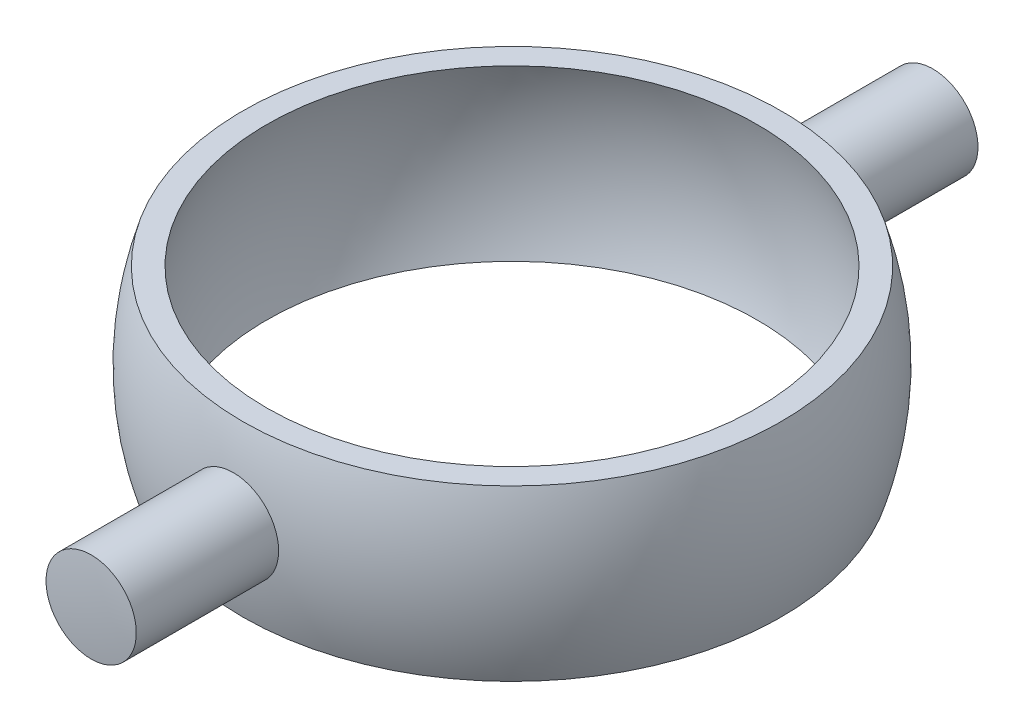
ISO-10303-21;
HEADER;
FILE_DESCRIPTION(('STEP AP214'),'2;1');
FILE_NAME('part.step','',(''),(''),'','','');
FILE_SCHEMA(('AUTOMOTIVE_DESIGN { 1 0 10303 214 1 1 1 1 }'));
ENDSEC;
DATA;
#1=APPLICATION_CONTEXT('core data for automotive mechanical design processes');
#2=APPLICATION_PROTOCOL_DEFINITION('international standard','automotive_design',2000,#1);
#3=PRODUCT_CONTEXT('',#1,'mechanical');
#4=PRODUCT('Part','Part','',(#3));
#5=PRODUCT_RELATED_PRODUCT_CATEGORY('part','',(#4));
#6=PRODUCT_DEFINITION_FORMATION('','',#4);
#7=PRODUCT_DEFINITION_CONTEXT('part definition',#1,'design');
#8=PRODUCT_DEFINITION('design','',#6,#7);
#9=PRODUCT_DEFINITION_SHAPE('','',#8);
#10=(LENGTH_UNIT() NAMED_UNIT(*) SI_UNIT(.MILLI.,.METRE.));
#11=(NAMED_UNIT(*) PLANE_ANGLE_UNIT() SI_UNIT($,.RADIAN.));
#12=(NAMED_UNIT(*) SI_UNIT($,.STERADIAN.) SOLID_ANGLE_UNIT());
#13=UNCERTAINTY_MEASURE_WITH_UNIT(LENGTH_MEASURE(1.E-05),#10,'distance_accuracy_value','');
#14=(GEOMETRIC_REPRESENTATION_CONTEXT(3) GLOBAL_UNCERTAINTY_ASSIGNED_CONTEXT((#13)) GLOBAL_UNIT_ASSIGNED_CONTEXT((#10,
#11,#12)) REPRESENTATION_CONTEXT('',''));
#15=CARTESIAN_POINT('',(0.,0.,0.));
#16=DIRECTION('',(0.,0.,1.));
#17=DIRECTION('',(1.,0.,0.));
#18=AXIS2_PLACEMENT_3D('',#15,#16,#17);
#19=CARTESIAN_POINT('',(0.,0.,0.));
#20=DIRECTION('',(0.,1.,0.));
#21=DIRECTION('',(-1.,0.,0.));
#22=AXIS2_PLACEMENT_3D('',#19,#20,#21);
#23=SPHERICAL_SURFACE('',#22,25.);
#24=CARTESIAN_POINT('',(0.,7.5,0.));
#25=DIRECTION('',(0.,1.,0.));
#26=DIRECTION('',(0.,0.,1.));
#27=AXIS2_PLACEMENT_3D('',#24,#25,#26);
#28=CIRCLE('',#27,23.8484800354236);
#29=CARTESIAN_POINT('',(0.,7.5,23.8484800354236));
#30=VERTEX_POINT('',#29);
#31=EDGE_CURVE('E73',#30,#30,#28,.T.);
#32=ORIENTED_EDGE('',*,*,#31,.F.);
#33=EDGE_LOOP('',(#32));
#34=FACE_BOUND('',#33,.T.);
#35=CARTESIAN_POINT('',(0.,-7.5,0.));
#36=DIRECTION('',(0.,1.,0.));
#37=DIRECTION('',(0.,0.,1.));
#38=AXIS2_PLACEMENT_3D('',#35,#36,#37);
#39=CIRCLE('',#38,23.8484800354236);
#40=CARTESIAN_POINT('',(0.,-7.5,23.8484800354236));
#41=VERTEX_POINT('',#40);
#42=EDGE_CURVE('E70',#41,#41,#39,.T.);
#43=ORIENTED_EDGE('',*,*,#42,.T.);
#44=EDGE_LOOP('',(#43));
#45=FACE_BOUND('',#44,.T.);
#46=CARTESIAN_POINT('',(0.,0.,24.6779253585061));
#47=DIRECTION('',(0.,0.,-1.));
#48=DIRECTION('',(-1.,0.,0.));
#49=AXIS2_PLACEMENT_3D('',#46,#47,#48);
#50=CIRCLE('',#49,4.);
#51=CARTESIAN_POINT('',(-4.,0.,24.6779253585061));
#52=VERTEX_POINT('',#51);
#53=EDGE_CURVE('E11',#52,#52,#50,.F.);
#54=ORIENTED_EDGE('',*,*,#53,.F.);
#55=EDGE_LOOP('',(#54));
#56=FACE_BOUND('',#55,.T.);
#57=CARTESIAN_POINT('',(0.,0.,-24.6779253585061));
#58=DIRECTION('',(0.,0.,1.));
#59=DIRECTION('',(1.,0.,0.));
#60=AXIS2_PLACEMENT_3D('',#57,#58,#59);
#61=CIRCLE('',#60,4.);
#62=CARTESIAN_POINT('',(4.,0.,-24.6779253585061));
#63=VERTEX_POINT('',#62);
#64=EDGE_CURVE('E61',#63,#63,#61,.F.);
#65=ORIENTED_EDGE('',*,*,#64,.F.);
#66=EDGE_LOOP('',(#65));
#67=FACE_BOUND('',#66,.T.);
#68=ADVANCED_FACE('F37',(#34,#45,#56,#67),#23,.T.);
#69=CARTESIAN_POINT('',(0.,0.,0.));
#70=DIRECTION('',(0.,1.,0.));
#71=DIRECTION('',(-1.,0.,0.));
#72=AXIS2_PLACEMENT_3D('',#69,#70,#71);
#73=SPHERICAL_SURFACE('',#72,23.);
#74=CARTESIAN_POINT('',(0.,7.5,0.));
#75=DIRECTION('',(0.,1.,0.));
#76=DIRECTION('',(0.,0.,1.));
#77=AXIS2_PLACEMENT_3D('',#74,#75,#76);
#78=CIRCLE('',#77,21.7428149051589);
#79=CARTESIAN_POINT('',(0.,7.5,21.7428149051589));
#80=VERTEX_POINT('',#79);
#81=EDGE_CURVE('E46',#80,#80,#78,.T.);
#82=ORIENTED_EDGE('',*,*,#81,.T.);
#83=EDGE_LOOP('',(#82));
#84=FACE_BOUND('',#83,.T.);
#85=CARTESIAN_POINT('',(0.,-7.5,0.));
#86=DIRECTION('',(0.,1.,0.));
#87=DIRECTION('',(0.,0.,1.));
#88=AXIS2_PLACEMENT_3D('',#85,#86,#87);
#89=CIRCLE('',#88,21.7428149051589);
#90=CARTESIAN_POINT('',(0.,-7.5,21.7428149051589));
#91=VERTEX_POINT('',#90);
#92=EDGE_CURVE('E64',#91,#91,#89,.T.);
#93=ORIENTED_EDGE('',*,*,#92,.F.);
#94=EDGE_LOOP('',(#93));
#95=FACE_BOUND('',#94,.T.);
#96=ADVANCED_FACE('F39',(#84,#95),#73,.F.);
#97=CARTESIAN_POINT('',(-23.8484800354236,7.5,0.));
#98=DIRECTION('',(0.,1.,0.));
#99=DIRECTION('',(0.,0.,1.));
#100=AXIS2_PLACEMENT_3D('',#97,#98,#99);
#101=PLANE('',#100);
#102=ORIENTED_EDGE('',*,*,#31,.T.);
#103=EDGE_LOOP('',(#102));
#104=FACE_BOUND('',#103,.T.);
#105=ORIENTED_EDGE('',*,*,#81,.F.);
#106=EDGE_LOOP('',(#105));
#107=FACE_BOUND('',#106,.T.);
#108=ADVANCED_FACE('F81',(#104,#107),#101,.T.);
#109=CARTESIAN_POINT('',(-21.7428149051589,-7.5,0.));
#110=DIRECTION('',(0.,-1.,0.));
#111=DIRECTION('',(0.,0.,-1.));
#112=AXIS2_PLACEMENT_3D('',#109,#110,#111);
#113=PLANE('',#112);
#114=ORIENTED_EDGE('',*,*,#92,.T.);
#115=EDGE_LOOP('',(#114));
#116=FACE_BOUND('',#115,.T.);
#117=ORIENTED_EDGE('',*,*,#42,.F.);
#118=EDGE_LOOP('',(#117));
#119=FACE_BOUND('',#118,.T.);
#120=ADVANCED_FACE('F83',(#116,#119),#113,.T.);
#121=CARTESIAN_POINT('',(0.,0.,-25.001));
#122=DIRECTION('',(0.,0.,1.));
#123=DIRECTION('',(1.,0.,0.));
#124=AXIS2_PLACEMENT_3D('',#121,#122,#123);
#125=CYLINDRICAL_SURFACE('',#124,4.);
#126=CARTESIAN_POINT('',(0.,0.,37.2860563750043));
#127=DIRECTION('',(0.,0.,-1.));
#128=DIRECTION('',(-1.,0.,0.));
#129=AXIS2_PLACEMENT_3D('',#126,#127,#128);
#130=CIRCLE('',#129,4.);
#131=CARTESIAN_POINT('',(-4.,0.,37.2860563750043));
#132=VERTEX_POINT('',#131);
#133=EDGE_CURVE('E59',#132,#132,#130,.F.);
#134=ORIENTED_EDGE('',*,*,#133,.F.);
#135=EDGE_LOOP('',(#134));
#136=FACE_BOUND('',#135,.T.);
#137=ORIENTED_EDGE('',*,*,#53,.T.);
#138=EDGE_LOOP('',(#137));
#139=FACE_BOUND('',#138,.T.);
#140=ADVANCED_FACE('F89',(#136,#139),#125,.T.);
#141=CARTESIAN_POINT('',(0.,0.,37.501));
#142=DIRECTION('',(0.,0.,-1.));
#143=DIRECTION('',(-1.,0.,0.));
#144=AXIS2_PLACEMENT_3D('',#141,#142,#143);
#145=CYLINDRICAL_SURFACE('',#144,4.);
#146=CARTESIAN_POINT('',(0.,0.,-37.2860563750043));
#147=DIRECTION('',(0.,0.,1.));
#148=DIRECTION('',(1.,0.,0.));
#149=AXIS2_PLACEMENT_3D('',#146,#147,#148);
#150=CIRCLE('',#149,4.);
#151=CARTESIAN_POINT('',(4.,0.,-37.2860563750043));
#152=VERTEX_POINT('',#151);
#153=EDGE_CURVE('E41',#152,#152,#150,.T.);
#154=ORIENTED_EDGE('',*,*,#153,.T.);
#155=EDGE_LOOP('',(#154));
#156=FACE_BOUND('',#155,.T.);
#157=ORIENTED_EDGE('',*,*,#64,.T.);
#158=EDGE_LOOP('',(#157));
#159=FACE_BOUND('',#158,.T.);
#160=ADVANCED_FACE('F102',(#156,#159),#145,.T.);
#161=CARTESIAN_POINT('',(0.,0.,0.));
#162=DIRECTION('',(0.,1.,0.));
#163=DIRECTION('',(0.,0.,1.));
#164=AXIS2_PLACEMENT_3D('',#161,#162,#163);
#165=SPHERICAL_SURFACE('',#164,37.5);
#166=CARTESIAN_POINT('',(0.,0.,-37.5));
#167=VERTEX_POINT('',#166);
#168=VERTEX_LOOP('',#167);
#169=FACE_BOUND('',#168,.T.);
#170=ORIENTED_EDGE('',*,*,#153,.F.);
#171=EDGE_LOOP('',(#170));
#172=FACE_BOUND('',#171,.T.);
#173=ADVANCED_FACE('F55',(#169,#172),#165,.T.);
#174=CARTESIAN_POINT('',(0.,0.,37.5));
#175=VERTEX_POINT('',#174);
#176=VERTEX_LOOP('',#175);
#177=FACE_BOUND('',#176,.T.);
#178=ORIENTED_EDGE('',*,*,#133,.T.);
#179=EDGE_LOOP('',(#178));
#180=FACE_BOUND('',#179,.T.);
#181=ADVANCED_FACE('F52',(#177,#180),#165,.T.);
#182=CLOSED_SHELL('',(#68,#96,#108,#120,#140,#160,#173,#181));
#183=MANIFOLD_SOLID_BREP('B2',#182);
#184=ADVANCED_BREP_SHAPE_REPRESENTATION('',(#18,#183),#14);
#185=SHAPE_DEFINITION_REPRESENTATION(#9,#184);
ENDSEC;
END-ISO-10303-21;
